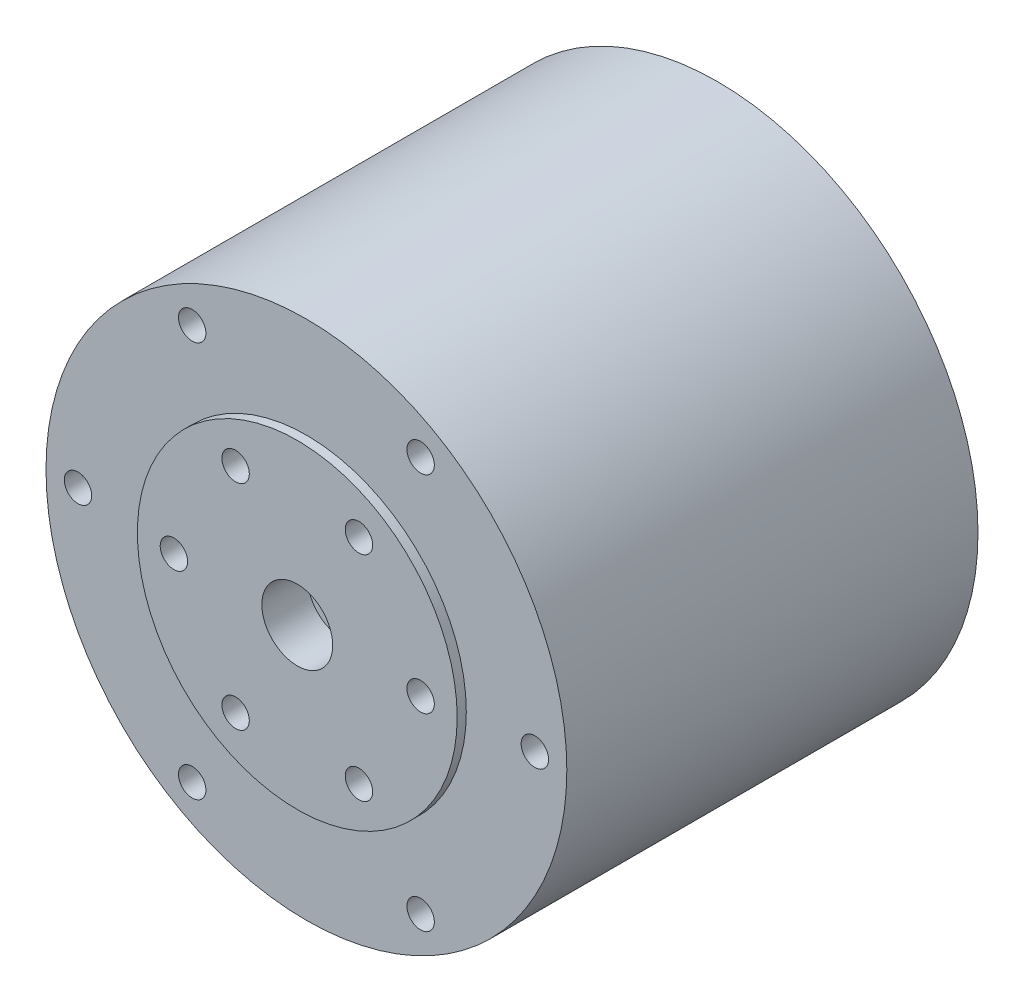
ISO-10303-21;
HEADER;
FILE_DESCRIPTION(('STEP AP214'),'2;1');
FILE_NAME('part.step','',(''),(''),'','','');
FILE_SCHEMA(('AUTOMOTIVE_DESIGN { 1 0 10303 214 1 1 1 1 }'));
ENDSEC;
DATA;
#1=APPLICATION_CONTEXT('core data for automotive mechanical design processes');
#2=APPLICATION_PROTOCOL_DEFINITION('international standard','automotive_design',2000,#1);
#3=PRODUCT_CONTEXT('',#1,'mechanical');
#4=PRODUCT('Part','Part','',(#3));
#5=PRODUCT_RELATED_PRODUCT_CATEGORY('part','',(#4));
#6=PRODUCT_DEFINITION_FORMATION('','',#4);
#7=PRODUCT_DEFINITION_CONTEXT('part definition',#1,'design');
#8=PRODUCT_DEFINITION('design','',#6,#7);
#9=PRODUCT_DEFINITION_SHAPE('','',#8);
#10=(LENGTH_UNIT() NAMED_UNIT(*) SI_UNIT(.MILLI.,.METRE.));
#11=(NAMED_UNIT(*) PLANE_ANGLE_UNIT() SI_UNIT($,.RADIAN.));
#12=(NAMED_UNIT(*) SI_UNIT($,.STERADIAN.) SOLID_ANGLE_UNIT());
#13=UNCERTAINTY_MEASURE_WITH_UNIT(LENGTH_MEASURE(1.E-05),#10,'distance_accuracy_value','');
#14=(GEOMETRIC_REPRESENTATION_CONTEXT(3) GLOBAL_UNCERTAINTY_ASSIGNED_CONTEXT((#13)) GLOBAL_UNIT_ASSIGNED_CONTEXT((#10,
#11,#12)) REPRESENTATION_CONTEXT('',''));
#15=CARTESIAN_POINT('',(0.,0.,0.));
#16=DIRECTION('',(0.,0.,1.));
#17=DIRECTION('',(1.,0.,0.));
#18=AXIS2_PLACEMENT_3D('',#15,#16,#17);
#19=CARTESIAN_POINT('',(0.,0.,45.));
#20=DIRECTION('',(0.,0.,-1.));
#21=DIRECTION('',(-1.,0.,0.));
#22=AXIS2_PLACEMENT_3D('',#19,#20,#21);
#23=CYLINDRICAL_SURFACE('',#22,28.5);
#24=CARTESIAN_POINT('',(0.,0.,45.));
#25=DIRECTION('',(0.,0.,1.));
#26=DIRECTION('',(1.,0.,0.));
#27=AXIS2_PLACEMENT_3D('',#24,#25,#26);
#28=CIRCLE('',#27,28.5);
#29=CARTESIAN_POINT('',(28.5,0.,45.));
#30=VERTEX_POINT('',#29);
#31=EDGE_CURVE('E48',#30,#30,#28,.T.);
#32=ORIENTED_EDGE('',*,*,#31,.F.);
#33=EDGE_LOOP('',(#32));
#34=FACE_BOUND('',#33,.T.);
#35=CARTESIAN_POINT('',(0.,0.,0.));
#36=DIRECTION('',(0.,0.,1.));
#37=DIRECTION('',(1.,0.,0.));
#38=AXIS2_PLACEMENT_3D('',#35,#36,#37);
#39=CIRCLE('',#38,28.5);
#40=CARTESIAN_POINT('',(28.5,0.,0.));
#41=VERTEX_POINT('',#40);
#42=EDGE_CURVE('E43',#41,#41,#39,.T.);
#43=ORIENTED_EDGE('',*,*,#42,.T.);
#44=EDGE_LOOP('',(#43));
#45=FACE_BOUND('',#44,.T.);
#46=ADVANCED_FACE('F40',(#34,#45),#23,.T.);
#47=CARTESIAN_POINT('',(0.,0.,45.));
#48=DIRECTION('',(0.,0.,1.));
#49=DIRECTION('',(1.,0.,0.));
#50=AXIS2_PLACEMENT_3D('',#47,#48,#49);
#51=PLANE('',#50);
#52=CARTESIAN_POINT('',(0.,0.,45.));
#53=DIRECTION('',(0.,0.,1.));
#54=DIRECTION('',(1.,0.,0.));
#55=AXIS2_PLACEMENT_3D('',#52,#53,#54);
#56=CIRCLE('',#55,17.5);
#57=CARTESIAN_POINT('',(17.5,0.,45.));
#58=VERTEX_POINT('',#57);
#59=EDGE_CURVE('E10',#58,#58,#56,.T.);
#60=ORIENTED_EDGE('',*,*,#59,.F.);
#61=EDGE_LOOP('',(#60));
#62=FACE_BOUND('',#61,.T.);
#63=CARTESIAN_POINT('',(25.,0.,45.));
#64=DIRECTION('',(0.,0.,1.));
#65=DIRECTION('',(1.,0.,0.));
#66=AXIS2_PLACEMENT_3D('',#63,#64,#65);
#67=CIRCLE('',#66,1.5);
#68=CARTESIAN_POINT('',(26.5,0.,45.));
#69=VERTEX_POINT('',#68);
#70=EDGE_CURVE('E91',#69,#69,#67,.T.);
#71=ORIENTED_EDGE('',*,*,#70,.F.);
#72=EDGE_LOOP('',(#71));
#73=FACE_BOUND('',#72,.T.);
#74=CARTESIAN_POINT('',(-25.,0.,45.));
#75=DIRECTION('',(0.,0.,1.));
#76=DIRECTION('',(1.,0.,0.));
#77=AXIS2_PLACEMENT_3D('',#74,#75,#76);
#78=CIRCLE('',#77,1.5);
#79=CARTESIAN_POINT('',(-23.5,0.,45.));
#80=VERTEX_POINT('',#79);
#81=EDGE_CURVE('E83',#80,#80,#78,.T.);
#82=ORIENTED_EDGE('',*,*,#81,.F.);
#83=EDGE_LOOP('',(#82));
#84=FACE_BOUND('',#83,.T.);
#85=CARTESIAN_POINT('',(12.5,-21.650635094611,45.));
#86=DIRECTION('',(0.,0.,1.));
#87=DIRECTION('',(1.,0.,0.));
#88=AXIS2_PLACEMENT_3D('',#85,#86,#87);
#89=CIRCLE('',#88,1.5);
#90=CARTESIAN_POINT('',(14.,-21.650635094611,45.));
#91=VERTEX_POINT('',#90);
#92=EDGE_CURVE('E75',#91,#91,#89,.T.);
#93=ORIENTED_EDGE('',*,*,#92,.F.);
#94=EDGE_LOOP('',(#93));
#95=FACE_BOUND('',#94,.T.);
#96=CARTESIAN_POINT('',(12.4999999999999,21.650635094611,45.));
#97=DIRECTION('',(0.,0.,1.));
#98=DIRECTION('',(1.,0.,0.));
#99=AXIS2_PLACEMENT_3D('',#96,#97,#98);
#100=CIRCLE('',#99,1.50000000000001);
#101=CARTESIAN_POINT('',(14.,21.650635094611,45.));
#102=VERTEX_POINT('',#101);
#103=EDGE_CURVE('E67',#102,#102,#100,.T.);
#104=ORIENTED_EDGE('',*,*,#103,.F.);
#105=EDGE_LOOP('',(#104));
#106=FACE_BOUND('',#105,.T.);
#107=CARTESIAN_POINT('',(-12.5,21.650635094611,45.));
#108=DIRECTION('',(0.,0.,1.));
#109=DIRECTION('',(1.,0.,0.));
#110=AXIS2_PLACEMENT_3D('',#107,#108,#109);
#111=CIRCLE('',#110,1.5);
#112=CARTESIAN_POINT('',(-11.,21.650635094611,45.));
#113=VERTEX_POINT('',#112);
#114=EDGE_CURVE('E58',#113,#113,#111,.T.);
#115=ORIENTED_EDGE('',*,*,#114,.F.);
#116=EDGE_LOOP('',(#115));
#117=FACE_BOUND('',#116,.T.);
#118=CARTESIAN_POINT('',(-12.4999999999999,-21.650635094611,45.));
#119=DIRECTION('',(0.,0.,1.));
#120=DIRECTION('',(1.,0.,0.));
#121=AXIS2_PLACEMENT_3D('',#118,#119,#120);
#122=CIRCLE('',#121,1.5);
#123=CARTESIAN_POINT('',(-10.9999999999999,-21.650635094611,45.));
#124=VERTEX_POINT('',#123);
#125=EDGE_CURVE('E62',#124,#124,#122,.T.);
#126=ORIENTED_EDGE('',*,*,#125,.F.);
#127=EDGE_LOOP('',(#126));
#128=FACE_BOUND('',#127,.T.);
#129=ORIENTED_EDGE('',*,*,#31,.T.);
#130=EDGE_LOOP('',(#129));
#131=FACE_BOUND('',#130,.T.);
#132=ADVANCED_FACE('F144',(#62,#73,#84,#95,#106,#117,#128,#131),#51,.T.);
#133=CARTESIAN_POINT('',(0.,0.,0.));
#134=DIRECTION('',(0.,0.,1.));
#135=DIRECTION('',(1.,0.,0.));
#136=AXIS2_PLACEMENT_3D('',#133,#134,#135);
#137=PLANE('',#136);
#138=CARTESIAN_POINT('',(-13.4350288425445,13.4350288425443,0.));
#139=DIRECTION('',(0.,0.,-1.));
#140=DIRECTION('',(-1.,0.,0.));
#141=AXIS2_PLACEMENT_3D('',#138,#139,#140);
#142=CIRCLE('',#141,1.5);
#143=CARTESIAN_POINT('',(-14.9350288425445,13.4350288425443,0.));
#144=VERTEX_POINT('',#143);
#145=EDGE_CURVE('E124',#144,#144,#142,.T.);
#146=ORIENTED_EDGE('',*,*,#145,.F.);
#147=EDGE_LOOP('',(#146));
#148=FACE_BOUND('',#147,.T.);
#149=CARTESIAN_POINT('',(13.4350288425444,13.4350288425444,0.));
#150=DIRECTION('',(0.,0.,-1.));
#151=DIRECTION('',(-1.,0.,0.));
#152=AXIS2_PLACEMENT_3D('',#149,#150,#151);
#153=CIRCLE('',#152,1.5);
#154=CARTESIAN_POINT('',(11.9350288425444,13.4350288425444,0.));
#155=VERTEX_POINT('',#154);
#156=EDGE_CURVE('E116',#155,#155,#153,.T.);
#157=ORIENTED_EDGE('',*,*,#156,.F.);
#158=EDGE_LOOP('',(#157));
#159=FACE_BOUND('',#158,.T.);
#160=CARTESIAN_POINT('',(13.4350288425445,-13.4350288425443,0.));
#161=DIRECTION('',(0.,0.,-1.));
#162=DIRECTION('',(-1.,0.,0.));
#163=AXIS2_PLACEMENT_3D('',#160,#161,#162);
#164=CIRCLE('',#163,1.5);
#165=CARTESIAN_POINT('',(11.9350288425445,-13.4350288425443,0.));
#166=VERTEX_POINT('',#165);
#167=EDGE_CURVE('E107',#166,#166,#164,.T.);
#168=ORIENTED_EDGE('',*,*,#167,.F.);
#169=EDGE_LOOP('',(#168));
#170=FACE_BOUND('',#169,.T.);
#171=CARTESIAN_POINT('',(-13.4350288425444,-13.4350288425444,0.));
#172=DIRECTION('',(0.,0.,-1.));
#173=DIRECTION('',(-1.,0.,0.));
#174=AXIS2_PLACEMENT_3D('',#171,#172,#173);
#175=CIRCLE('',#174,1.5);
#176=CARTESIAN_POINT('',(-14.9350288425444,-13.4350288425444,0.));
#177=VERTEX_POINT('',#176);
#178=EDGE_CURVE('E111',#177,#177,#175,.T.);
#179=ORIENTED_EDGE('',*,*,#178,.F.);
#180=EDGE_LOOP('',(#179));
#181=FACE_BOUND('',#180,.T.);
#182=ORIENTED_EDGE('',*,*,#42,.F.);
#183=EDGE_LOOP('',(#182));
#184=FACE_BOUND('',#183,.T.);
#185=ADVANCED_FACE('F141',(#148,#159,#170,#181,#184),#137,.F.);
#186=CARTESIAN_POINT('',(-13.4350288425444,-13.4350288425444,4.));
#187=DIRECTION('',(0.,0.,-1.));
#188=DIRECTION('',(-1.,0.,0.));
#189=AXIS2_PLACEMENT_3D('',#186,#187,#188);
#190=CYLINDRICAL_SURFACE('',#189,1.5);
#191=CARTESIAN_POINT('',(-13.4350288425444,-13.4350288425444,4.));
#192=DIRECTION('',(0.,0.,-1.));
#193=DIRECTION('',(-1.,0.,0.));
#194=AXIS2_PLACEMENT_3D('',#191,#192,#193);
#195=CIRCLE('',#194,1.5);
#196=CARTESIAN_POINT('',(-14.9350288425444,-13.4350288425444,4.));
#197=VERTEX_POINT('',#196);
#198=EDGE_CURVE('E131',#197,#197,#195,.T.);
#199=ORIENTED_EDGE('',*,*,#198,.F.);
#200=EDGE_LOOP('',(#199));
#201=FACE_BOUND('',#200,.T.);
#202=ORIENTED_EDGE('',*,*,#178,.T.);
#203=EDGE_LOOP('',(#202));
#204=FACE_BOUND('',#203,.T.);
#205=ADVANCED_FACE('F139',(#201,#204),#190,.F.);
#206=CARTESIAN_POINT('',(-13.4350288425444,-13.4350288425444,4.));
#207=DIRECTION('',(0.,0.,-1.));
#208=DIRECTION('',(-1.,0.,0.));
#209=AXIS2_PLACEMENT_3D('',#206,#207,#208);
#210=PLANE('',#209);
#211=ORIENTED_EDGE('',*,*,#198,.T.);
#212=EDGE_LOOP('',(#211));
#213=FACE_BOUND('',#212,.T.);
#214=ADVANCED_FACE('F165',(#213),#210,.T.);
#215=CARTESIAN_POINT('',(13.4350288425445,-13.4350288425443,4.));
#216=DIRECTION('',(0.,0.,-1.));
#217=DIRECTION('',(-1.,0.,0.));
#218=AXIS2_PLACEMENT_3D('',#215,#216,#217);
#219=CYLINDRICAL_SURFACE('',#218,1.5);
#220=CARTESIAN_POINT('',(13.4350288425445,-13.4350288425443,4.));
#221=DIRECTION('',(0.,0.,-1.));
#222=DIRECTION('',(-1.,0.,0.));
#223=AXIS2_PLACEMENT_3D('',#220,#221,#222);
#224=CIRCLE('',#223,1.5);
#225=CARTESIAN_POINT('',(11.9350288425445,-13.4350288425443,4.));
#226=VERTEX_POINT('',#225);
#227=EDGE_CURVE('E112',#226,#226,#224,.T.);
#228=ORIENTED_EDGE('',*,*,#227,.F.);
#229=EDGE_LOOP('',(#228));
#230=FACE_BOUND('',#229,.T.);
#231=ORIENTED_EDGE('',*,*,#167,.T.);
#232=EDGE_LOOP('',(#231));
#233=FACE_BOUND('',#232,.T.);
#234=ADVANCED_FACE('F169',(#230,#233),#219,.F.);
#235=CARTESIAN_POINT('',(13.4350288425445,-13.4350288425443,4.));
#236=DIRECTION('',(0.,0.,-1.));
#237=DIRECTION('',(-1.,0.,0.));
#238=AXIS2_PLACEMENT_3D('',#235,#236,#237);
#239=PLANE('',#238);
#240=ORIENTED_EDGE('',*,*,#227,.T.);
#241=EDGE_LOOP('',(#240));
#242=FACE_BOUND('',#241,.T.);
#243=ADVANCED_FACE('F187',(#242),#239,.T.);
#244=CARTESIAN_POINT('',(13.4350288425444,13.4350288425444,4.));
#245=DIRECTION('',(0.,0.,-1.));
#246=DIRECTION('',(-1.,0.,0.));
#247=AXIS2_PLACEMENT_3D('',#244,#245,#246);
#248=CYLINDRICAL_SURFACE('',#247,1.5);
#249=CARTESIAN_POINT('',(13.4350288425444,13.4350288425444,4.));
#250=DIRECTION('',(0.,0.,-1.));
#251=DIRECTION('',(-1.,0.,0.));
#252=AXIS2_PLACEMENT_3D('',#249,#250,#251);
#253=CIRCLE('',#252,1.5);
#254=CARTESIAN_POINT('',(11.9350288425444,13.4350288425444,4.));
#255=VERTEX_POINT('',#254);
#256=EDGE_CURVE('E120',#255,#255,#253,.T.);
#257=ORIENTED_EDGE('',*,*,#256,.F.);
#258=EDGE_LOOP('',(#257));
#259=FACE_BOUND('',#258,.T.);
#260=ORIENTED_EDGE('',*,*,#156,.T.);
#261=EDGE_LOOP('',(#260));
#262=FACE_BOUND('',#261,.T.);
#263=ADVANCED_FACE('F183',(#259,#262),#248,.F.);
#264=CARTESIAN_POINT('',(13.4350288425444,13.4350288425444,4.));
#265=DIRECTION('',(0.,0.,-1.));
#266=DIRECTION('',(-1.,0.,0.));
#267=AXIS2_PLACEMENT_3D('',#264,#265,#266);
#268=PLANE('',#267);
#269=ORIENTED_EDGE('',*,*,#256,.T.);
#270=EDGE_LOOP('',(#269));
#271=FACE_BOUND('',#270,.T.);
#272=ADVANCED_FACE('F179',(#271),#268,.T.);
#273=CARTESIAN_POINT('',(-13.4350288425445,13.4350288425443,4.));
#274=DIRECTION('',(0.,0.,-1.));
#275=DIRECTION('',(-1.,0.,0.));
#276=AXIS2_PLACEMENT_3D('',#273,#274,#275);
#277=CYLINDRICAL_SURFACE('',#276,1.5);
#278=CARTESIAN_POINT('',(-13.4350288425445,13.4350288425443,4.));
#279=DIRECTION('',(0.,0.,-1.));
#280=DIRECTION('',(-1.,0.,0.));
#281=AXIS2_PLACEMENT_3D('',#278,#279,#280);
#282=CIRCLE('',#281,1.5);
#283=CARTESIAN_POINT('',(-14.9350288425445,13.4350288425443,4.));
#284=VERTEX_POINT('',#283);
#285=EDGE_CURVE('E103',#284,#284,#282,.T.);
#286=ORIENTED_EDGE('',*,*,#285,.F.);
#287=EDGE_LOOP('',(#286));
#288=FACE_BOUND('',#287,.T.);
#289=ORIENTED_EDGE('',*,*,#145,.T.);
#290=EDGE_LOOP('',(#289));
#291=FACE_BOUND('',#290,.T.);
#292=ADVANCED_FACE('F175',(#288,#291),#277,.F.);
#293=CARTESIAN_POINT('',(-13.4350288425445,13.4350288425443,4.));
#294=DIRECTION('',(0.,0.,-1.));
#295=DIRECTION('',(-1.,0.,0.));
#296=AXIS2_PLACEMENT_3D('',#293,#294,#295);
#297=PLANE('',#296);
#298=ORIENTED_EDGE('',*,*,#285,.T.);
#299=EDGE_LOOP('',(#298));
#300=FACE_BOUND('',#299,.T.);
#301=ADVANCED_FACE('F171',(#300),#297,.T.);
#302=CARTESIAN_POINT('',(-12.4999999999999,-21.650635094611,40.));
#303=DIRECTION('',(0.,0.,1.));
#304=DIRECTION('',(1.,0.,0.));
#305=AXIS2_PLACEMENT_3D('',#302,#303,#304);
#306=CYLINDRICAL_SURFACE('',#305,1.5);
#307=CARTESIAN_POINT('',(-12.4999999999999,-21.650635094611,40.));
#308=DIRECTION('',(0.,0.,1.));
#309=DIRECTION('',(1.,0.,0.));
#310=AXIS2_PLACEMENT_3D('',#307,#308,#309);
#311=CIRCLE('',#310,1.5);
#312=CARTESIAN_POINT('',(-10.9999999999999,-21.650635094611,40.));
#313=VERTEX_POINT('',#312);
#314=EDGE_CURVE('E99',#313,#313,#311,.T.);
#315=ORIENTED_EDGE('',*,*,#314,.F.);
#316=EDGE_LOOP('',(#315));
#317=FACE_BOUND('',#316,.T.);
#318=ORIENTED_EDGE('',*,*,#125,.T.);
#319=EDGE_LOOP('',(#318));
#320=FACE_BOUND('',#319,.T.);
#321=ADVANCED_FACE('F174',(#317,#320),#306,.F.);
#322=CARTESIAN_POINT('',(-12.4999999999999,-21.650635094611,40.));
#323=DIRECTION('',(0.,0.,1.));
#324=DIRECTION('',(1.,0.,0.));
#325=AXIS2_PLACEMENT_3D('',#322,#323,#324);
#326=PLANE('',#325);
#327=ORIENTED_EDGE('',*,*,#314,.T.);
#328=EDGE_LOOP('',(#327));
#329=FACE_BOUND('',#328,.T.);
#330=ADVANCED_FACE('F197',(#329),#326,.T.);
#331=CARTESIAN_POINT('',(-12.5,21.650635094611,40.));
#332=DIRECTION('',(0.,0.,1.));
#333=DIRECTION('',(1.,0.,0.));
#334=AXIS2_PLACEMENT_3D('',#331,#332,#333);
#335=CYLINDRICAL_SURFACE('',#334,1.5);
#336=CARTESIAN_POINT('',(-12.5,21.650635094611,40.));
#337=DIRECTION('',(0.,0.,1.));
#338=DIRECTION('',(1.,0.,0.));
#339=AXIS2_PLACEMENT_3D('',#336,#337,#338);
#340=CIRCLE('',#339,1.5);
#341=CARTESIAN_POINT('',(-11.,21.650635094611,40.));
#342=VERTEX_POINT('',#341);
#343=EDGE_CURVE('E63',#342,#342,#340,.T.);
#344=ORIENTED_EDGE('',*,*,#343,.F.);
#345=EDGE_LOOP('',(#344));
#346=FACE_BOUND('',#345,.T.);
#347=ORIENTED_EDGE('',*,*,#114,.T.);
#348=EDGE_LOOP('',(#347));
#349=FACE_BOUND('',#348,.T.);
#350=ADVANCED_FACE('F201',(#346,#349),#335,.F.);
#351=CARTESIAN_POINT('',(-12.5,21.650635094611,40.));
#352=DIRECTION('',(0.,0.,1.));
#353=DIRECTION('',(1.,0.,0.));
#354=AXIS2_PLACEMENT_3D('',#351,#352,#353);
#355=PLANE('',#354);
#356=ORIENTED_EDGE('',*,*,#343,.T.);
#357=EDGE_LOOP('',(#356));
#358=FACE_BOUND('',#357,.T.);
#359=ADVANCED_FACE('F235',(#358),#355,.T.);
#360=CARTESIAN_POINT('',(12.4999999999999,21.650635094611,40.));
#361=DIRECTION('',(0.,0.,1.));
#362=DIRECTION('',(1.,0.,0.));
#363=AXIS2_PLACEMENT_3D('',#360,#361,#362);
#364=CYLINDRICAL_SURFACE('',#363,1.50000000000001);
#365=CARTESIAN_POINT('',(12.4999999999999,21.650635094611,40.));
#366=DIRECTION('',(0.,0.,1.));
#367=DIRECTION('',(1.,0.,0.));
#368=AXIS2_PLACEMENT_3D('',#365,#366,#367);
#369=CIRCLE('',#368,1.50000000000001);
#370=CARTESIAN_POINT('',(14.,21.650635094611,40.));
#371=VERTEX_POINT('',#370);
#372=EDGE_CURVE('E71',#371,#371,#369,.T.);
#373=ORIENTED_EDGE('',*,*,#372,.F.);
#374=EDGE_LOOP('',(#373));
#375=FACE_BOUND('',#374,.T.);
#376=ORIENTED_EDGE('',*,*,#103,.T.);
#377=EDGE_LOOP('',(#376));
#378=FACE_BOUND('',#377,.T.);
#379=ADVANCED_FACE('F231',(#375,#378),#364,.F.);
#380=CARTESIAN_POINT('',(12.4999999999999,21.650635094611,40.));
#381=DIRECTION('',(0.,0.,1.));
#382=DIRECTION('',(1.,0.,0.));
#383=AXIS2_PLACEMENT_3D('',#380,#381,#382);
#384=PLANE('',#383);
#385=ORIENTED_EDGE('',*,*,#372,.T.);
#386=EDGE_LOOP('',(#385));
#387=FACE_BOUND('',#386,.T.);
#388=ADVANCED_FACE('F227',(#387),#384,.T.);
#389=CARTESIAN_POINT('',(12.5,-21.650635094611,40.));
#390=DIRECTION('',(0.,0.,1.));
#391=DIRECTION('',(1.,0.,0.));
#392=AXIS2_PLACEMENT_3D('',#389,#390,#391);
#393=CYLINDRICAL_SURFACE('',#392,1.5);
#394=CARTESIAN_POINT('',(12.5,-21.650635094611,40.));
#395=DIRECTION('',(0.,0.,1.));
#396=DIRECTION('',(1.,0.,0.));
#397=AXIS2_PLACEMENT_3D('',#394,#395,#396);
#398=CIRCLE('',#397,1.5);
#399=CARTESIAN_POINT('',(14.,-21.650635094611,40.));
#400=VERTEX_POINT('',#399);
#401=EDGE_CURVE('E79',#400,#400,#398,.T.);
#402=ORIENTED_EDGE('',*,*,#401,.F.);
#403=EDGE_LOOP('',(#402));
#404=FACE_BOUND('',#403,.T.);
#405=ORIENTED_EDGE('',*,*,#92,.T.);
#406=EDGE_LOOP('',(#405));
#407=FACE_BOUND('',#406,.T.);
#408=ADVANCED_FACE('F223',(#404,#407),#393,.F.);
#409=CARTESIAN_POINT('',(12.5,-21.650635094611,40.));
#410=DIRECTION('',(0.,0.,1.));
#411=DIRECTION('',(1.,0.,0.));
#412=AXIS2_PLACEMENT_3D('',#409,#410,#411);
#413=PLANE('',#412);
#414=ORIENTED_EDGE('',*,*,#401,.T.);
#415=EDGE_LOOP('',(#414));
#416=FACE_BOUND('',#415,.T.);
#417=ADVANCED_FACE('F219',(#416),#413,.T.);
#418=CARTESIAN_POINT('',(-25.,0.,40.));
#419=DIRECTION('',(0.,0.,1.));
#420=DIRECTION('',(1.,0.,0.));
#421=AXIS2_PLACEMENT_3D('',#418,#419,#420);
#422=CYLINDRICAL_SURFACE('',#421,1.5);
#423=CARTESIAN_POINT('',(-25.,0.,40.));
#424=DIRECTION('',(0.,0.,1.));
#425=DIRECTION('',(1.,0.,0.));
#426=AXIS2_PLACEMENT_3D('',#423,#424,#425);
#427=CIRCLE('',#426,1.5);
#428=CARTESIAN_POINT('',(-23.5,0.,40.));
#429=VERTEX_POINT('',#428);
#430=EDGE_CURVE('E87',#429,#429,#427,.T.);
#431=ORIENTED_EDGE('',*,*,#430,.F.);
#432=EDGE_LOOP('',(#431));
#433=FACE_BOUND('',#432,.T.);
#434=ORIENTED_EDGE('',*,*,#81,.T.);
#435=EDGE_LOOP('',(#434));
#436=FACE_BOUND('',#435,.T.);
#437=ADVANCED_FACE('F215',(#433,#436),#422,.F.);
#438=CARTESIAN_POINT('',(-25.,0.,40.));
#439=DIRECTION('',(0.,0.,1.));
#440=DIRECTION('',(1.,0.,0.));
#441=AXIS2_PLACEMENT_3D('',#438,#439,#440);
#442=PLANE('',#441);
#443=ORIENTED_EDGE('',*,*,#430,.T.);
#444=EDGE_LOOP('',(#443));
#445=FACE_BOUND('',#444,.T.);
#446=ADVANCED_FACE('F211',(#445),#442,.T.);
#447=CARTESIAN_POINT('',(25.,0.,40.));
#448=DIRECTION('',(0.,0.,1.));
#449=DIRECTION('',(1.,0.,0.));
#450=AXIS2_PLACEMENT_3D('',#447,#448,#449);
#451=CYLINDRICAL_SURFACE('',#450,1.5);
#452=CARTESIAN_POINT('',(25.,0.,40.));
#453=DIRECTION('',(0.,0.,1.));
#454=DIRECTION('',(1.,0.,0.));
#455=AXIS2_PLACEMENT_3D('',#452,#453,#454);
#456=CIRCLE('',#455,1.5);
#457=CARTESIAN_POINT('',(26.5,0.,40.));
#458=VERTEX_POINT('',#457);
#459=EDGE_CURVE('E95',#458,#458,#456,.T.);
#460=ORIENTED_EDGE('',*,*,#459,.F.);
#461=EDGE_LOOP('',(#460));
#462=FACE_BOUND('',#461,.T.);
#463=ORIENTED_EDGE('',*,*,#70,.T.);
#464=EDGE_LOOP('',(#463));
#465=FACE_BOUND('',#464,.T.);
#466=ADVANCED_FACE('F207',(#462,#465),#451,.F.);
#467=CARTESIAN_POINT('',(25.,0.,40.));
#468=DIRECTION('',(0.,0.,1.));
#469=DIRECTION('',(1.,0.,0.));
#470=AXIS2_PLACEMENT_3D('',#467,#468,#469);
#471=PLANE('',#470);
#472=ORIENTED_EDGE('',*,*,#459,.T.);
#473=EDGE_LOOP('',(#472));
#474=FACE_BOUND('',#473,.T.);
#475=ADVANCED_FACE('F203',(#474),#471,.T.);
#476=CARTESIAN_POINT('',(0.,0.,46.));
#477=DIRECTION('',(0.,0.,-1.));
#478=DIRECTION('',(-1.,0.,0.));
#479=AXIS2_PLACEMENT_3D('',#476,#477,#478);
#480=CYLINDRICAL_SURFACE('',#479,17.5);
#481=CARTESIAN_POINT('',(0.,0.,46.));
#482=DIRECTION('',(0.,0.,1.));
#483=DIRECTION('',(1.,0.,0.));
#484=AXIS2_PLACEMENT_3D('',#481,#482,#483);
#485=CIRCLE('',#484,17.5);
#486=CARTESIAN_POINT('',(17.5,0.,46.));
#487=VERTEX_POINT('',#486);
#488=EDGE_CURVE('E56',#487,#487,#485,.T.);
#489=ORIENTED_EDGE('',*,*,#488,.F.);
#490=EDGE_LOOP('',(#489));
#491=FACE_BOUND('',#490,.T.);
#492=ORIENTED_EDGE('',*,*,#59,.T.);
#493=EDGE_LOOP('',(#492));
#494=FACE_BOUND('',#493,.T.);
#495=ADVANCED_FACE('F206',(#491,#494),#480,.T.);
#496=CARTESIAN_POINT('',(0.,0.,46.));
#497=DIRECTION('',(0.,0.,1.));
#498=DIRECTION('',(1.,0.,0.));
#499=AXIS2_PLACEMENT_3D('',#496,#497,#498);
#500=PLANE('',#499);
#501=CARTESIAN_POINT('',(13.5,0.,46.));
#502=DIRECTION('',(0.,0.,1.));
#503=DIRECTION('',(1.,0.,0.));
#504=AXIS2_PLACEMENT_3D('',#501,#502,#503);
#505=CIRCLE('',#504,1.5);
#506=CARTESIAN_POINT('',(15.,0.,46.));
#507=VERTEX_POINT('',#506);
#508=EDGE_CURVE('E311',#507,#507,#505,.T.);
#509=ORIENTED_EDGE('',*,*,#508,.F.);
#510=EDGE_LOOP('',(#509));
#511=FACE_BOUND('',#510,.T.);
#512=CARTESIAN_POINT('',(0.,0.,46.));
#513=DIRECTION('',(0.,0.,1.));
#514=DIRECTION('',(1.,0.,0.));
#515=AXIS2_PLACEMENT_3D('',#512,#513,#514);
#516=CIRCLE('',#515,3.87630949736402);
#517=CARTESIAN_POINT('',(3.87630949736402,0.,46.));
#518=VERTEX_POINT('',#517);
#519=EDGE_CURVE('E329',#518,#518,#516,.T.);
#520=ORIENTED_EDGE('',*,*,#519,.F.);
#521=EDGE_LOOP('',(#520));
#522=FACE_BOUND('',#521,.T.);
#523=CARTESIAN_POINT('',(6.74999999999997,-11.6913429510899,46.));
#524=DIRECTION('',(0.,0.,1.));
#525=DIRECTION('',(1.,0.,0.));
#526=AXIS2_PLACEMENT_3D('',#523,#524,#525);
#527=CIRCLE('',#526,1.5);
#528=CARTESIAN_POINT('',(8.24999999999997,-11.6913429510899,46.));
#529=VERTEX_POINT('',#528);
#530=EDGE_CURVE('E320',#529,#529,#527,.T.);
#531=ORIENTED_EDGE('',*,*,#530,.F.);
#532=EDGE_LOOP('',(#531));
#533=FACE_BOUND('',#532,.T.);
#534=CARTESIAN_POINT('',(-13.5,0.,46.));
#535=DIRECTION('',(0.,0.,1.));
#536=DIRECTION('',(1.,0.,0.));
#537=AXIS2_PLACEMENT_3D('',#534,#535,#536);
#538=CIRCLE('',#537,1.5);
#539=CARTESIAN_POINT('',(-12.,0.,46.));
#540=VERTEX_POINT('',#539);
#541=EDGE_CURVE('E317',#540,#540,#538,.T.);
#542=ORIENTED_EDGE('',*,*,#541,.F.);
#543=EDGE_LOOP('',(#542));
#544=FACE_BOUND('',#543,.T.);
#545=CARTESIAN_POINT('',(6.75000000000005,11.6913429510899,46.));
#546=DIRECTION('',(0.,0.,1.));
#547=DIRECTION('',(1.,0.,0.));
#548=AXIS2_PLACEMENT_3D('',#545,#546,#547);
#549=CIRCLE('',#548,1.5);
#550=CARTESIAN_POINT('',(8.25000000000005,11.6913429510899,46.));
#551=VERTEX_POINT('',#550);
#552=EDGE_CURVE('E360',#551,#551,#549,.T.);
#553=ORIENTED_EDGE('',*,*,#552,.F.);
#554=EDGE_LOOP('',(#553));
#555=FACE_BOUND('',#554,.T.);
#556=CARTESIAN_POINT('',(-6.74999999999997,11.6913429510899,46.));
#557=DIRECTION('',(0.,0.,1.));
#558=DIRECTION('',(1.,0.,0.));
#559=AXIS2_PLACEMENT_3D('',#556,#557,#558);
#560=CIRCLE('',#559,1.5);
#561=CARTESIAN_POINT('',(-5.24999999999997,11.6913429510899,46.));
#562=VERTEX_POINT('',#561);
#563=EDGE_CURVE('E337',#562,#562,#560,.T.);
#564=ORIENTED_EDGE('',*,*,#563,.F.);
#565=EDGE_LOOP('',(#564));
#566=FACE_BOUND('',#565,.T.);
#567=CARTESIAN_POINT('',(-6.75000000000006,-11.6913429510899,46.));
#568=DIRECTION('',(0.,0.,1.));
#569=DIRECTION('',(1.,0.,0.));
#570=AXIS2_PLACEMENT_3D('',#567,#568,#569);
#571=CIRCLE('',#570,1.5);
#572=CARTESIAN_POINT('',(-5.25000000000005,-11.6913429510899,46.));
#573=VERTEX_POINT('',#572);
#574=EDGE_CURVE('E346',#573,#573,#571,.T.);
#575=ORIENTED_EDGE('',*,*,#574,.F.);
#576=EDGE_LOOP('',(#575));
#577=FACE_BOUND('',#576,.T.);
#578=ORIENTED_EDGE('',*,*,#488,.T.);
#579=EDGE_LOOP('',(#578));
#580=FACE_BOUND('',#579,.T.);
#581=ADVANCED_FACE('F245',(#511,#522,#533,#544,#555,#566,#577,#580),#500,.T.);
#582=CARTESIAN_POINT('',(-6.75000000000006,-11.6913429510899,41.));
#583=DIRECTION('',(0.,0.,1.));
#584=DIRECTION('',(1.,0.,0.));
#585=AXIS2_PLACEMENT_3D('',#582,#583,#584);
#586=CYLINDRICAL_SURFACE('',#585,1.5);
#587=CARTESIAN_POINT('',(-6.75000000000006,-11.6913429510899,41.));
#588=DIRECTION('',(0.,0.,1.));
#589=DIRECTION('',(1.,0.,0.));
#590=AXIS2_PLACEMENT_3D('',#587,#588,#589);
#591=CIRCLE('',#590,1.5);
#592=CARTESIAN_POINT('',(-5.25000000000005,-11.6913429510899,41.));
#593=VERTEX_POINT('',#592);
#594=EDGE_CURVE('E324',#593,#593,#591,.T.);
#595=ORIENTED_EDGE('',*,*,#594,.F.);
#596=EDGE_LOOP('',(#595));
#597=FACE_BOUND('',#596,.T.);
#598=ORIENTED_EDGE('',*,*,#574,.T.);
#599=EDGE_LOOP('',(#598));
#600=FACE_BOUND('',#599,.T.);
#601=ADVANCED_FACE('F249',(#597,#600),#586,.F.);
#602=CARTESIAN_POINT('',(-6.75000000000006,-11.6913429510899,41.));
#603=DIRECTION('',(0.,0.,1.));
#604=DIRECTION('',(1.,0.,0.));
#605=AXIS2_PLACEMENT_3D('',#602,#603,#604);
#606=PLANE('',#605);
#607=ORIENTED_EDGE('',*,*,#594,.T.);
#608=EDGE_LOOP('',(#607));
#609=FACE_BOUND('',#608,.T.);
#610=ADVANCED_FACE('F269',(#609),#606,.T.);
#611=CARTESIAN_POINT('',(-6.74999999999997,11.6913429510899,41.));
#612=DIRECTION('',(0.,0.,1.));
#613=DIRECTION('',(1.,0.,0.));
#614=AXIS2_PLACEMENT_3D('',#611,#612,#613);
#615=CYLINDRICAL_SURFACE('',#614,1.5);
#616=CARTESIAN_POINT('',(-6.74999999999997,11.6913429510899,41.));
#617=DIRECTION('',(0.,0.,1.));
#618=DIRECTION('',(1.,0.,0.));
#619=AXIS2_PLACEMENT_3D('',#616,#617,#618);
#620=CIRCLE('',#619,1.5);
#621=CARTESIAN_POINT('',(-5.24999999999997,11.6913429510899,41.));
#622=VERTEX_POINT('',#621);
#623=EDGE_CURVE('E342',#622,#622,#620,.T.);
#624=ORIENTED_EDGE('',*,*,#623,.F.);
#625=EDGE_LOOP('',(#624));
#626=FACE_BOUND('',#625,.T.);
#627=ORIENTED_EDGE('',*,*,#563,.T.);
#628=EDGE_LOOP('',(#627));
#629=FACE_BOUND('',#628,.T.);
#630=ADVANCED_FACE('F272',(#626,#629),#615,.F.);
#631=CARTESIAN_POINT('',(-6.74999999999997,11.6913429510899,41.));
#632=DIRECTION('',(0.,0.,1.));
#633=DIRECTION('',(1.,0.,0.));
#634=AXIS2_PLACEMENT_3D('',#631,#632,#633);
#635=PLANE('',#634);
#636=ORIENTED_EDGE('',*,*,#623,.T.);
#637=EDGE_LOOP('',(#636));
#638=FACE_BOUND('',#637,.T.);
#639=ADVANCED_FACE('F259',(#638),#635,.T.);
#640=CARTESIAN_POINT('',(6.75000000000005,11.6913429510899,41.));
#641=DIRECTION('',(0.,0.,1.));
#642=DIRECTION('',(1.,0.,0.));
#643=AXIS2_PLACEMENT_3D('',#640,#641,#642);
#644=CYLINDRICAL_SURFACE('',#643,1.5);
#645=CARTESIAN_POINT('',(6.75000000000005,11.6913429510899,41.));
#646=DIRECTION('',(0.,0.,1.));
#647=DIRECTION('',(1.,0.,0.));
#648=AXIS2_PLACEMENT_3D('',#645,#646,#647);
#649=CIRCLE('',#648,1.5);
#650=CARTESIAN_POINT('',(8.25000000000005,11.6913429510899,41.));
#651=VERTEX_POINT('',#650);
#652=EDGE_CURVE('E341',#651,#651,#649,.T.);
#653=ORIENTED_EDGE('',*,*,#652,.F.);
#654=EDGE_LOOP('',(#653));
#655=FACE_BOUND('',#654,.T.);
#656=ORIENTED_EDGE('',*,*,#552,.T.);
#657=EDGE_LOOP('',(#656));
#658=FACE_BOUND('',#657,.T.);
#659=ADVANCED_FACE('F255',(#655,#658),#644,.F.);
#660=CARTESIAN_POINT('',(6.75000000000005,11.6913429510899,41.));
#661=DIRECTION('',(0.,0.,1.));
#662=DIRECTION('',(1.,0.,0.));
#663=AXIS2_PLACEMENT_3D('',#660,#661,#662);
#664=PLANE('',#663);
#665=ORIENTED_EDGE('',*,*,#652,.T.);
#666=EDGE_LOOP('',(#665));
#667=FACE_BOUND('',#666,.T.);
#668=ADVANCED_FACE('F251',(#667),#664,.T.);
#669=CARTESIAN_POINT('',(-13.5,0.,41.));
#670=DIRECTION('',(0.,0.,1.));
#671=DIRECTION('',(1.,0.,0.));
#672=AXIS2_PLACEMENT_3D('',#669,#670,#671);
#673=CYLINDRICAL_SURFACE('',#672,1.5);
#674=CARTESIAN_POINT('',(-13.5,0.,41.));
#675=DIRECTION('',(0.,0.,1.));
#676=DIRECTION('',(1.,0.,0.));
#677=AXIS2_PLACEMENT_3D('',#674,#675,#676);
#678=CIRCLE('',#677,1.5);
#679=CARTESIAN_POINT('',(-12.,0.,41.));
#680=VERTEX_POINT('',#679);
#681=EDGE_CURVE('E356',#680,#680,#678,.T.);
#682=ORIENTED_EDGE('',*,*,#681,.F.);
#683=EDGE_LOOP('',(#682));
#684=FACE_BOUND('',#683,.T.);
#685=ORIENTED_EDGE('',*,*,#541,.T.);
#686=EDGE_LOOP('',(#685));
#687=FACE_BOUND('',#686,.T.);
#688=ADVANCED_FACE('F254',(#684,#687),#673,.F.);
#689=CARTESIAN_POINT('',(-13.5,0.,41.));
#690=DIRECTION('',(0.,0.,1.));
#691=DIRECTION('',(1.,0.,0.));
#692=AXIS2_PLACEMENT_3D('',#689,#690,#691);
#693=PLANE('',#692);
#694=ORIENTED_EDGE('',*,*,#681,.T.);
#695=EDGE_LOOP('',(#694));
#696=FACE_BOUND('',#695,.T.);
#697=ADVANCED_FACE('F261',(#696),#693,.T.);
#698=CARTESIAN_POINT('',(6.74999999999997,-11.6913429510899,41.));
#699=DIRECTION('',(0.,0.,1.));
#700=DIRECTION('',(1.,0.,0.));
#701=AXIS2_PLACEMENT_3D('',#698,#699,#700);
#702=CYLINDRICAL_SURFACE('',#701,1.5);
#703=CARTESIAN_POINT('',(6.74999999999997,-11.6913429510899,41.));
#704=DIRECTION('',(0.,0.,1.));
#705=DIRECTION('',(1.,0.,0.));
#706=AXIS2_PLACEMENT_3D('',#703,#704,#705);
#707=CIRCLE('',#706,1.5);
#708=CARTESIAN_POINT('',(8.24999999999997,-11.6913429510899,41.));
#709=VERTEX_POINT('',#708);
#710=EDGE_CURVE('E325',#709,#709,#707,.T.);
#711=ORIENTED_EDGE('',*,*,#710,.F.);
#712=EDGE_LOOP('',(#711));
#713=FACE_BOUND('',#712,.T.);
#714=ORIENTED_EDGE('',*,*,#530,.T.);
#715=EDGE_LOOP('',(#714));
#716=FACE_BOUND('',#715,.T.);
#717=ADVANCED_FACE('F264',(#713,#716),#702,.F.);
#718=CARTESIAN_POINT('',(6.74999999999997,-11.6913429510899,41.));
#719=DIRECTION('',(0.,0.,1.));
#720=DIRECTION('',(1.,0.,0.));
#721=AXIS2_PLACEMENT_3D('',#718,#719,#720);
#722=PLANE('',#721);
#723=ORIENTED_EDGE('',*,*,#710,.T.);
#724=EDGE_LOOP('',(#723));
#725=FACE_BOUND('',#724,.T.);
#726=ADVANCED_FACE('F291',(#725),#722,.T.);
#727=CARTESIAN_POINT('',(0.,0.,41.));
#728=DIRECTION('',(0.,0.,1.));
#729=DIRECTION('',(1.,0.,0.));
#730=AXIS2_PLACEMENT_3D('',#727,#728,#729);
#731=CYLINDRICAL_SURFACE('',#730,3.87630949736402);
#732=CARTESIAN_POINT('',(0.,0.,41.));
#733=DIRECTION('',(0.,0.,1.));
#734=DIRECTION('',(1.,0.,0.));
#735=AXIS2_PLACEMENT_3D('',#732,#733,#734);
#736=CIRCLE('',#735,3.87630949736402);
#737=CARTESIAN_POINT('',(3.87630949736402,0.,41.));
#738=VERTEX_POINT('',#737);
#739=EDGE_CURVE('E333',#738,#738,#736,.T.);
#740=ORIENTED_EDGE('',*,*,#739,.F.);
#741=EDGE_LOOP('',(#740));
#742=FACE_BOUND('',#741,.T.);
#743=ORIENTED_EDGE('',*,*,#519,.T.);
#744=EDGE_LOOP('',(#743));
#745=FACE_BOUND('',#744,.T.);
#746=ADVANCED_FACE('F287',(#742,#745),#731,.F.);
#747=CARTESIAN_POINT('',(0.,0.,41.));
#748=DIRECTION('',(0.,0.,1.));
#749=DIRECTION('',(1.,0.,0.));
#750=AXIS2_PLACEMENT_3D('',#747,#748,#749);
#751=PLANE('',#750);
#752=ORIENTED_EDGE('',*,*,#739,.T.);
#753=EDGE_LOOP('',(#752));
#754=FACE_BOUND('',#753,.T.);
#755=ADVANCED_FACE('F283',(#754),#751,.T.);
#756=CARTESIAN_POINT('',(13.5,0.,41.));
#757=DIRECTION('',(0.,0.,1.));
#758=DIRECTION('',(1.,0.,0.));
#759=AXIS2_PLACEMENT_3D('',#756,#757,#758);
#760=CYLINDRICAL_SURFACE('',#759,1.5);
#761=CARTESIAN_POINT('',(13.5,0.,41.));
#762=DIRECTION('',(0.,0.,1.));
#763=DIRECTION('',(1.,0.,0.));
#764=AXIS2_PLACEMENT_3D('',#761,#762,#763);
#765=CIRCLE('',#764,1.5);
#766=CARTESIAN_POINT('',(15.,0.,41.));
#767=VERTEX_POINT('',#766);
#768=EDGE_CURVE('E309',#767,#767,#765,.T.);
#769=ORIENTED_EDGE('',*,*,#768,.F.);
#770=EDGE_LOOP('',(#769));
#771=FACE_BOUND('',#770,.T.);
#772=ORIENTED_EDGE('',*,*,#508,.T.);
#773=EDGE_LOOP('',(#772));
#774=FACE_BOUND('',#773,.T.);
#775=ADVANCED_FACE('F286',(#771,#774),#760,.F.);
#776=CARTESIAN_POINT('',(13.5,0.,41.));
#777=DIRECTION('',(0.,0.,1.));
#778=DIRECTION('',(1.,0.,0.));
#779=AXIS2_PLACEMENT_3D('',#776,#777,#778);
#780=PLANE('',#779);
#781=ORIENTED_EDGE('',*,*,#768,.T.);
#782=EDGE_LOOP('',(#781));
#783=FACE_BOUND('',#782,.T.);
#784=ADVANCED_FACE('F301',(#783),#780,.T.);
#785=CLOSED_SHELL('',(#46,#132,#185,#205,#214,#234,#243,#263,#272,#292,#301,#321,#330,#350,#359,
#379,#388,#408,#417,#437,#446,#466,#475,#495,#581,#601,#610,#630,#639,#659,#668,#688,#697,#717,
#726,#746,#755,#775,#784));
#786=MANIFOLD_SOLID_BREP('B2',#785);
#787=ADVANCED_BREP_SHAPE_REPRESENTATION('',(#18,#786),#14);
#788=SHAPE_DEFINITION_REPRESENTATION(#9,#787);
ENDSEC;
END-ISO-10303-21;
